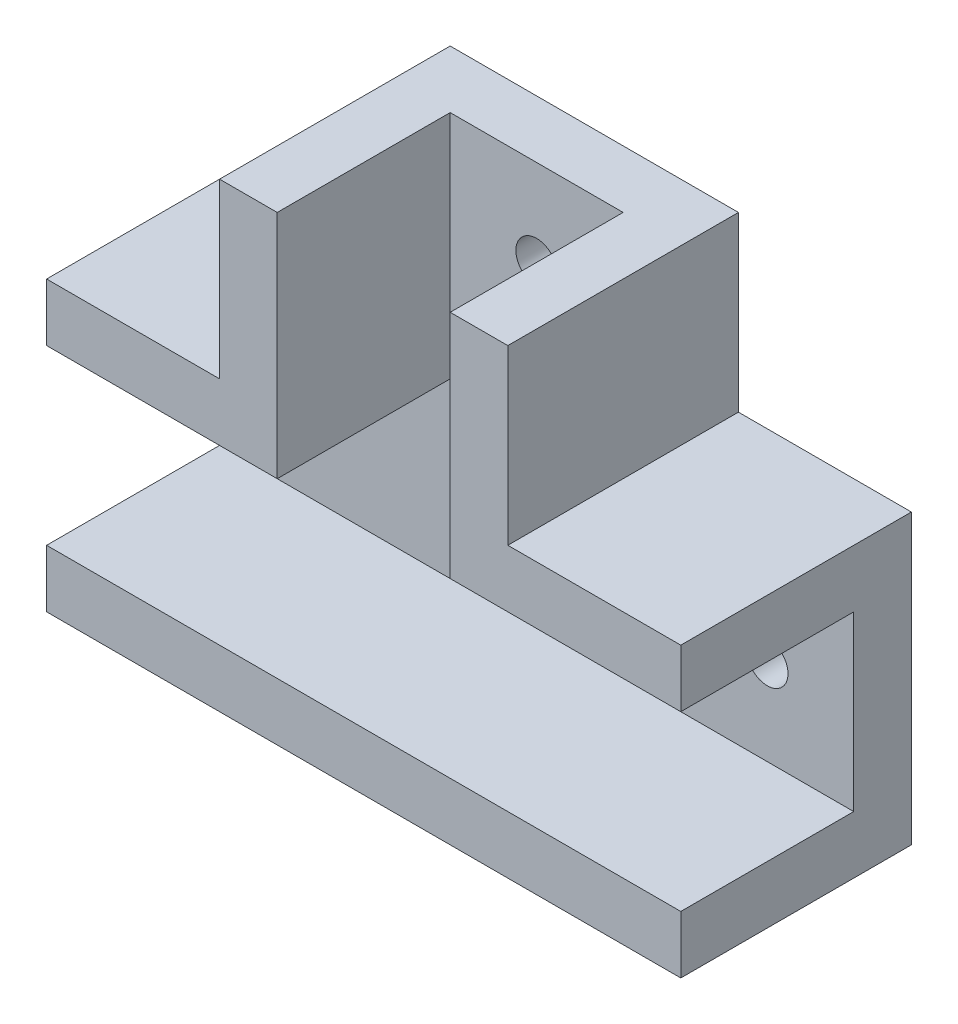
ISO-10303-21;
HEADER;
FILE_DESCRIPTION(('STEP AP214'),'2;1');
FILE_NAME('part.step','',(''),(''),'','','');
FILE_SCHEMA(('AUTOMOTIVE_DESIGN { 1 0 10303 214 1 1 1 1 }'));
ENDSEC;
DATA;
#1=APPLICATION_CONTEXT('core data for automotive mechanical design processes');
#2=APPLICATION_PROTOCOL_DEFINITION('international standard','automotive_design',2000,#1);
#3=PRODUCT_CONTEXT('',#1,'mechanical');
#4=PRODUCT('Part','Part','',(#3));
#5=PRODUCT_RELATED_PRODUCT_CATEGORY('part','',(#4));
#6=PRODUCT_DEFINITION_FORMATION('','',#4);
#7=PRODUCT_DEFINITION_CONTEXT('part definition',#1,'design');
#8=PRODUCT_DEFINITION('design','',#6,#7);
#9=PRODUCT_DEFINITION_SHAPE('','',#8);
#10=(LENGTH_UNIT() NAMED_UNIT(*) SI_UNIT(.MILLI.,.METRE.));
#11=(NAMED_UNIT(*) PLANE_ANGLE_UNIT() SI_UNIT($,.RADIAN.));
#12=(NAMED_UNIT(*) SI_UNIT($,.STERADIAN.) SOLID_ANGLE_UNIT());
#13=UNCERTAINTY_MEASURE_WITH_UNIT(LENGTH_MEASURE(1.E-05),#10,'distance_accuracy_value','');
#14=(GEOMETRIC_REPRESENTATION_CONTEXT(3) GLOBAL_UNCERTAINTY_ASSIGNED_CONTEXT((#13)) GLOBAL_UNIT_ASSIGNED_CONTEXT((#10,
#11,#12)) REPRESENTATION_CONTEXT('',''));
#15=CARTESIAN_POINT('',(0.,0.,0.));
#16=DIRECTION('',(0.,0.,1.));
#17=DIRECTION('',(1.,0.,0.));
#18=AXIS2_PLACEMENT_3D('',#15,#16,#17);
#19=CARTESIAN_POINT('',(-20.6862745098039,-4.26470588235294,5.));
#20=DIRECTION('',(1.,0.,0.));
#21=DIRECTION('',(0.,1.,0.));
#22=AXIS2_PLACEMENT_3D('',#19,#20,#21);
#23=PLANE('',#22);
#24=DIRECTION('',(0.,-1.,0.));
#25=VECTOR('',#24,1.);
#26=CARTESIAN_POINT('',(-20.6862745098039,-4.26470588235294,0.));
#27=LINE('',#26,#25);
#28=CARTESIAN_POINT('',(-20.6862745098039,0.735294117647059,0.));
#29=VERTEX_POINT('',#28);
#30=CARTESIAN_POINT('',(-20.6862745098039,-24.2647058823529,0.));
#31=VERTEX_POINT('',#30);
#32=EDGE_CURVE('E248',#29,#31,#27,.T.);
#33=ORIENTED_EDGE('',*,*,#32,.T.);
#34=DIRECTION('',(0.,0.,-1.));
#35=VECTOR('',#34,1.);
#36=CARTESIAN_POINT('',(-20.6862745098039,-24.2647058823529,20.));
#37=LINE('',#36,#35);
#38=CARTESIAN_POINT('',(-20.6862745098039,-24.2647058823529,20.));
#39=VERTEX_POINT('',#38);
#40=EDGE_CURVE('E213',#39,#31,#37,.T.);
#41=ORIENTED_EDGE('',*,*,#40,.F.);
#42=DIRECTION('',(0.,1.,0.));
#43=VECTOR('',#42,1.);
#44=CARTESIAN_POINT('',(-20.6862745098039,-24.2647058823529,20.));
#45=LINE('',#44,#43);
#46=CARTESIAN_POINT('',(-20.6862745098039,-19.2647058823529,20.));
#47=VERTEX_POINT('',#46);
#48=EDGE_CURVE('E198',#39,#47,#45,.T.);
#49=ORIENTED_EDGE('',*,*,#48,.T.);
#50=DIRECTION('',(0.,0.,-1.));
#51=VECTOR('',#50,1.);
#52=CARTESIAN_POINT('',(-20.6862745098039,-19.2647058823529,20.));
#53=LINE('',#52,#51);
#54=CARTESIAN_POINT('',(-20.6862745098039,-19.2647058823529,5.));
#55=VERTEX_POINT('',#54);
#56=EDGE_CURVE('E210',#47,#55,#53,.T.);
#57=ORIENTED_EDGE('',*,*,#56,.T.);
#58=DIRECTION('',(0.,-1.,0.));
#59=VECTOR('',#58,1.);
#60=CARTESIAN_POINT('',(-20.6862745098039,-4.26470588235294,5.));
#61=LINE('',#60,#59);
#62=CARTESIAN_POINT('',(-20.6862745098039,-4.26470588235294,5.));
#63=VERTEX_POINT('',#62);
#64=EDGE_CURVE('E262',#63,#55,#61,.T.);
#65=ORIENTED_EDGE('',*,*,#64,.F.);
#66=DIRECTION('',(0.,0.,-1.));
#67=VECTOR('',#66,1.);
#68=CARTESIAN_POINT('',(-20.6862745098039,-4.26470588235294,20.));
#69=LINE('',#68,#67);
#70=CARTESIAN_POINT('',(-20.6862745098039,-4.26470588235294,20.));
#71=VERTEX_POINT('',#70);
#72=EDGE_CURVE('E245',#71,#63,#69,.T.);
#73=ORIENTED_EDGE('',*,*,#72,.F.);
#74=DIRECTION('',(0.,1.,0.));
#75=VECTOR('',#74,1.);
#76=CARTESIAN_POINT('',(-20.6862745098039,-4.26470588235294,20.));
#77=LINE('',#76,#75);
#78=CARTESIAN_POINT('',(-20.6862745098039,0.735294117647059,20.));
#79=VERTEX_POINT('',#78);
#80=EDGE_CURVE('E224',#71,#79,#77,.T.);
#81=ORIENTED_EDGE('',*,*,#80,.T.);
#82=DIRECTION('',(0.,0.,-1.));
#83=VECTOR('',#82,1.);
#84=CARTESIAN_POINT('',(-20.6862745098039,0.735294117647059,20.));
#85=LINE('',#84,#83);
#86=EDGE_CURVE('E240',#79,#29,#85,.T.);
#87=ORIENTED_EDGE('',*,*,#86,.T.);
#88=EDGE_LOOP('',(#33,#41,#49,#57,#65,#73,#81,#87));
#89=FACE_BOUND('',#88,.T.);
#90=ADVANCED_FACE('F33',(#89),#23,.F.);
#91=CARTESIAN_POINT('',(34.3137254901961,-4.26470588235294,5.));
#92=DIRECTION('',(-1.,0.,0.));
#93=DIRECTION('',(0.,0.,1.));
#94=AXIS2_PLACEMENT_3D('',#91,#92,#93);
#95=PLANE('',#94);
#96=DIRECTION('',(0.,1.,0.));
#97=VECTOR('',#96,1.);
#98=CARTESIAN_POINT('',(34.3137254901961,-4.26470588235294,0.));
#99=LINE('',#98,#97);
#100=CARTESIAN_POINT('',(34.3137254901961,-24.2647058823529,0.));
#101=VERTEX_POINT('',#100);
#102=CARTESIAN_POINT('',(34.3137254901961,0.735294117647054,0.));
#103=VERTEX_POINT('',#102);
#104=EDGE_CURVE('E275',#101,#103,#99,.T.);
#105=ORIENTED_EDGE('',*,*,#104,.T.);
#106=DIRECTION('',(0.,0.,-1.));
#107=VECTOR('',#106,1.);
#108=CARTESIAN_POINT('',(34.3137254901961,0.735294117647054,20.));
#109=LINE('',#108,#107);
#110=CARTESIAN_POINT('',(34.3137254901961,0.735294117647054,20.));
#111=VERTEX_POINT('',#110);
#112=EDGE_CURVE('E161',#111,#103,#109,.T.);
#113=ORIENTED_EDGE('',*,*,#112,.F.);
#114=DIRECTION('',(0.,1.,0.));
#115=VECTOR('',#114,1.);
#116=CARTESIAN_POINT('',(34.3137254901961,-4.26470588235295,20.));
#117=LINE('',#116,#115);
#118=CARTESIAN_POINT('',(34.3137254901961,-4.26470588235295,20.));
#119=VERTEX_POINT('',#118);
#120=EDGE_CURVE('E158',#119,#111,#117,.T.);
#121=ORIENTED_EDGE('',*,*,#120,.F.);
#122=DIRECTION('',(0.,0.,-1.));
#123=VECTOR('',#122,1.);
#124=CARTESIAN_POINT('',(34.3137254901961,-4.26470588235295,20.));
#125=LINE('',#124,#123);
#126=CARTESIAN_POINT('',(34.3137254901961,-4.26470588235294,5.));
#127=VERTEX_POINT('',#126);
#128=EDGE_CURVE('E144',#119,#127,#125,.T.);
#129=ORIENTED_EDGE('',*,*,#128,.T.);
#130=DIRECTION('',(0.,1.,0.));
#131=VECTOR('',#130,1.);
#132=CARTESIAN_POINT('',(34.3137254901961,-4.26470588235294,5.));
#133=LINE('',#132,#131);
#134=CARTESIAN_POINT('',(34.3137254901961,-19.2647058823529,5.));
#135=VERTEX_POINT('',#134);
#136=EDGE_CURVE('E267',#135,#127,#133,.T.);
#137=ORIENTED_EDGE('',*,*,#136,.F.);
#138=DIRECTION('',(0.,0.,-1.));
#139=VECTOR('',#138,1.);
#140=CARTESIAN_POINT('',(34.3137254901961,-19.2647058823529,20.));
#141=LINE('',#140,#139);
#142=CARTESIAN_POINT('',(34.3137254901961,-19.2647058823529,20.));
#143=VERTEX_POINT('',#142);
#144=EDGE_CURVE('E220',#143,#135,#141,.T.);
#145=ORIENTED_EDGE('',*,*,#144,.F.);
#146=DIRECTION('',(0.,-1.,0.));
#147=VECTOR('',#146,1.);
#148=CARTESIAN_POINT('',(34.3137254901961,-19.2647058823529,20.));
#149=LINE('',#148,#147);
#150=CARTESIAN_POINT('',(34.3137254901961,-24.2647058823529,20.));
#151=VERTEX_POINT('',#150);
#152=EDGE_CURVE('E204',#143,#151,#149,.T.);
#153=ORIENTED_EDGE('',*,*,#152,.T.);
#154=DIRECTION('',(0.,0.,-1.));
#155=VECTOR('',#154,1.);
#156=CARTESIAN_POINT('',(34.3137254901961,-24.2647058823529,20.));
#157=LINE('',#156,#155);
#158=EDGE_CURVE('E217',#151,#101,#157,.T.);
#159=ORIENTED_EDGE('',*,*,#158,.T.);
#160=EDGE_LOOP('',(#105,#113,#121,#129,#137,#145,#153,#159));
#161=FACE_BOUND('',#160,.T.);
#162=ADVANCED_FACE('F159',(#161),#95,.F.);
#163=CARTESIAN_POINT('',(-0.686274509803913,15.7352941176471,5.));
#164=DIRECTION('',(0.,-1.,0.));
#165=DIRECTION('',(0.,0.,-1.));
#166=AXIS2_PLACEMENT_3D('',#163,#164,#165);
#167=PLANE('',#166);
#168=DIRECTION('',(-1.,0.,0.));
#169=VECTOR('',#168,1.);
#170=CARTESIAN_POINT('',(-0.686274509803913,15.7352941176471,0.));
#171=LINE('',#170,#169);
#172=CARTESIAN_POINT('',(19.3137254901961,15.7352941176471,0.));
#173=VERTEX_POINT('',#172);
#174=CARTESIAN_POINT('',(-5.68627450980391,15.7352941176471,0.));
#175=VERTEX_POINT('',#174);
#176=EDGE_CURVE('E36',#173,#175,#171,.T.);
#177=ORIENTED_EDGE('',*,*,#176,.T.);
#178=DIRECTION('',(0.,0.,-1.));
#179=VECTOR('',#178,1.);
#180=CARTESIAN_POINT('',(-5.68627450980391,15.7352941176471,20.));
#181=LINE('',#180,#179);
#182=CARTESIAN_POINT('',(-5.68627450980391,15.7352941176471,20.));
#183=VERTEX_POINT('',#182);
#184=EDGE_CURVE('E255',#183,#175,#181,.T.);
#185=ORIENTED_EDGE('',*,*,#184,.F.);
#186=DIRECTION('',(-1.,0.,0.));
#187=VECTOR('',#186,1.);
#188=CARTESIAN_POINT('',(-0.686274509803913,15.7352941176471,20.));
#189=LINE('',#188,#187);
#190=CARTESIAN_POINT('',(-0.686274509803913,15.7352941176471,20.));
#191=VERTEX_POINT('',#190);
#192=EDGE_CURVE('E233',#191,#183,#189,.T.);
#193=ORIENTED_EDGE('',*,*,#192,.F.);
#194=DIRECTION('',(0.,0.,-1.));
#195=VECTOR('',#194,1.);
#196=CARTESIAN_POINT('',(-0.686274509803913,15.7352941176471,20.));
#197=LINE('',#196,#195);
#198=CARTESIAN_POINT('',(-0.686274509803913,15.7352941176471,5.));
#199=VERTEX_POINT('',#198);
#200=EDGE_CURVE('E252',#191,#199,#197,.T.);
#201=ORIENTED_EDGE('',*,*,#200,.T.);
#202=DIRECTION('',(-1.,0.,0.));
#203=VECTOR('',#202,1.);
#204=CARTESIAN_POINT('',(-0.686274509803913,15.7352941176471,5.));
#205=LINE('',#204,#203);
#206=CARTESIAN_POINT('',(14.3137254901961,15.7352941176471,5.));
#207=VERTEX_POINT('',#206);
#208=EDGE_CURVE('E272',#207,#199,#205,.T.);
#209=ORIENTED_EDGE('',*,*,#208,.F.);
#210=DIRECTION('',(0.,0.,-1.));
#211=VECTOR('',#210,1.);
#212=CARTESIAN_POINT('',(14.3137254901961,15.7352941176471,20.));
#213=LINE('',#212,#211);
#214=CARTESIAN_POINT('',(14.3137254901961,15.7352941176471,20.));
#215=VERTEX_POINT('',#214);
#216=EDGE_CURVE('E194',#215,#207,#213,.T.);
#217=ORIENTED_EDGE('',*,*,#216,.F.);
#218=DIRECTION('',(1.,0.,0.));
#219=VECTOR('',#218,1.);
#220=CARTESIAN_POINT('',(14.3137254901961,15.7352941176471,20.));
#221=LINE('',#220,#219);
#222=CARTESIAN_POINT('',(19.3137254901961,15.7352941176471,20.));
#223=VERTEX_POINT('',#222);
#224=EDGE_CURVE('E171',#215,#223,#221,.T.);
#225=ORIENTED_EDGE('',*,*,#224,.T.);
#226=DIRECTION('',(0.,0.,-1.));
#227=VECTOR('',#226,1.);
#228=CARTESIAN_POINT('',(19.3137254901961,15.7352941176471,20.));
#229=LINE('',#228,#227);
#230=EDGE_CURVE('E191',#223,#173,#229,.T.);
#231=ORIENTED_EDGE('',*,*,#230,.T.);
#232=EDGE_LOOP('',(#177,#185,#193,#201,#209,#217,#225,#231));
#233=FACE_BOUND('',#232,.T.);
#234=ADVANCED_FACE('F279',(#233),#167,.F.);
#235=CARTESIAN_POINT('',(0.,0.,5.));
#236=DIRECTION('',(0.,0.,1.));
#237=DIRECTION('',(1.,0.,0.));
#238=AXIS2_PLACEMENT_3D('',#235,#236,#237);
#239=PLANE('',#238);
#240=CARTESIAN_POINT('',(6.81372549019609,8.23529411764706,5.));
#241=DIRECTION('',(0.,0.,1.));
#242=DIRECTION('',(1.,0.,0.));
#243=AXIS2_PLACEMENT_3D('',#240,#241,#242);
#244=CIRCLE('',#243,1.8);
#245=CARTESIAN_POINT('',(8.61372549019609,8.23529411764706,5.));
#246=VERTEX_POINT('',#245);
#247=EDGE_CURVE('E530',#246,#246,#244,.T.);
#248=ORIENTED_EDGE('',*,*,#247,.F.);
#249=EDGE_LOOP('',(#248));
#250=FACE_BOUND('',#249,.T.);
#251=CARTESIAN_POINT('',(-13.1862745098039,-11.7647058823529,5.));
#252=DIRECTION('',(0.,0.,1.));
#253=DIRECTION('',(1.,0.,0.));
#254=AXIS2_PLACEMENT_3D('',#251,#252,#253);
#255=CIRCLE('',#254,1.8);
#256=CARTESIAN_POINT('',(-11.3862745098039,-11.7647058823529,5.));
#257=VERTEX_POINT('',#256);
#258=EDGE_CURVE('E535',#257,#257,#255,.T.);
#259=ORIENTED_EDGE('',*,*,#258,.F.);
#260=EDGE_LOOP('',(#259));
#261=FACE_BOUND('',#260,.T.);
#262=CARTESIAN_POINT('',(26.8137254901961,-11.7647058823529,5.));
#263=DIRECTION('',(0.,0.,1.));
#264=DIRECTION('',(1.,0.,0.));
#265=AXIS2_PLACEMENT_3D('',#262,#263,#264);
#266=CIRCLE('',#265,1.8);
#267=CARTESIAN_POINT('',(28.6137254901961,-11.7647058823529,5.));
#268=VERTEX_POINT('',#267);
#269=EDGE_CURVE('E542',#268,#268,#266,.T.);
#270=ORIENTED_EDGE('',*,*,#269,.F.);
#271=EDGE_LOOP('',(#270));
#272=FACE_BOUND('',#271,.T.);
#273=ORIENTED_EDGE('',*,*,#64,.T.);
#274=DIRECTION('',(1.,0.,0.));
#275=VECTOR('',#274,1.);
#276=CARTESIAN_POINT('',(-20.6862745098039,-19.2647058823529,5.));
#277=LINE('',#276,#275);
#278=EDGE_CURVE('E264',#55,#135,#277,.T.);
#279=ORIENTED_EDGE('',*,*,#278,.T.);
#280=ORIENTED_EDGE('',*,*,#136,.T.);
#281=DIRECTION('',(-1.,0.,0.));
#282=VECTOR('',#281,1.);
#283=CARTESIAN_POINT('',(14.3137254901961,-4.26470588235294,5.));
#284=LINE('',#283,#282);
#285=CARTESIAN_POINT('',(14.3137254901961,-4.26470588235294,5.));
#286=VERTEX_POINT('',#285);
#287=EDGE_CURVE('E150',#127,#286,#284,.T.);
#288=ORIENTED_EDGE('',*,*,#287,.T.);
#289=DIRECTION('',(0.,1.,0.));
#290=VECTOR('',#289,1.);
#291=CARTESIAN_POINT('',(14.3137254901961,15.7352941176471,5.));
#292=LINE('',#291,#290);
#293=EDGE_CURVE('E270',#286,#207,#292,.T.);
#294=ORIENTED_EDGE('',*,*,#293,.T.);
#295=ORIENTED_EDGE('',*,*,#208,.T.);
#296=DIRECTION('',(0.,-1.,0.));
#297=VECTOR('',#296,1.);
#298=CARTESIAN_POINT('',(-0.686274509803913,15.7352941176471,5.));
#299=LINE('',#298,#297);
#300=CARTESIAN_POINT('',(-0.68627450980391,-4.26470588235294,5.));
#301=VERTEX_POINT('',#300);
#302=EDGE_CURVE('E41',#199,#301,#299,.T.);
#303=ORIENTED_EDGE('',*,*,#302,.T.);
#304=DIRECTION('',(-1.,0.,0.));
#305=VECTOR('',#304,1.);
#306=CARTESIAN_POINT('',(-20.6862745098039,-4.26470588235294,5.));
#307=LINE('',#306,#305);
#308=EDGE_CURVE('E11',#301,#63,#307,.T.);
#309=ORIENTED_EDGE('',*,*,#308,.T.);
#310=EDGE_LOOP('',(#273,#279,#280,#288,#294,#295,#303,#309));
#311=FACE_BOUND('',#310,.T.);
#312=ADVANCED_FACE('F312',(#250,#261,#272,#311),#239,.T.);
#313=CARTESIAN_POINT('',(0.,0.,0.));
#314=DIRECTION('',(0.,0.,1.));
#315=DIRECTION('',(1.,0.,0.));
#316=AXIS2_PLACEMENT_3D('',#313,#314,#315);
#317=PLANE('',#316);
#318=CARTESIAN_POINT('',(6.81372549019609,8.23529411764706,0.));
#319=DIRECTION('',(0.,0.,1.));
#320=DIRECTION('',(1.,0.,0.));
#321=AXIS2_PLACEMENT_3D('',#318,#319,#320);
#322=CIRCLE('',#321,1.8);
#323=CARTESIAN_POINT('',(8.61372549019609,8.23529411764706,0.));
#324=VERTEX_POINT('',#323);
#325=EDGE_CURVE('E184',#324,#324,#322,.T.);
#326=ORIENTED_EDGE('',*,*,#325,.T.);
#327=EDGE_LOOP('',(#326));
#328=FACE_BOUND('',#327,.T.);
#329=CARTESIAN_POINT('',(-13.1862745098039,-11.7647058823529,0.));
#330=DIRECTION('',(0.,0.,1.));
#331=DIRECTION('',(1.,0.,0.));
#332=AXIS2_PLACEMENT_3D('',#329,#330,#331);
#333=CIRCLE('',#332,1.8);
#334=CARTESIAN_POINT('',(-11.3862745098039,-11.7647058823529,0.));
#335=VERTEX_POINT('',#334);
#336=EDGE_CURVE('E531',#335,#335,#333,.T.);
#337=ORIENTED_EDGE('',*,*,#336,.T.);
#338=EDGE_LOOP('',(#337));
#339=FACE_BOUND('',#338,.T.);
#340=CARTESIAN_POINT('',(26.8137254901961,-11.7647058823529,0.));
#341=DIRECTION('',(0.,0.,1.));
#342=DIRECTION('',(1.,0.,0.));
#343=AXIS2_PLACEMENT_3D('',#340,#341,#342);
#344=CIRCLE('',#343,1.8);
#345=CARTESIAN_POINT('',(28.6137254901961,-11.7647058823529,0.));
#346=VERTEX_POINT('',#345);
#347=EDGE_CURVE('E540',#346,#346,#344,.T.);
#348=ORIENTED_EDGE('',*,*,#347,.T.);
#349=EDGE_LOOP('',(#348));
#350=FACE_BOUND('',#349,.T.);
#351=ORIENTED_EDGE('',*,*,#176,.F.);
#352=DIRECTION('',(0.,-1.,0.));
#353=VECTOR('',#352,1.);
#354=CARTESIAN_POINT('',(19.3137254901961,15.7352941176471,0.));
#355=LINE('',#354,#353);
#356=CARTESIAN_POINT('',(19.3137254901961,0.735294117647055,0.));
#357=VERTEX_POINT('',#356);
#358=EDGE_CURVE('E181',#173,#357,#355,.T.);
#359=ORIENTED_EDGE('',*,*,#358,.T.);
#360=DIRECTION('',(-1.,0.,0.));
#361=VECTOR('',#360,1.);
#362=CARTESIAN_POINT('',(34.3137254901961,0.735294117647054,0.));
#363=LINE('',#362,#361);
#364=EDGE_CURVE('E163',#103,#357,#363,.T.);
#365=ORIENTED_EDGE('',*,*,#364,.F.);
#366=ORIENTED_EDGE('',*,*,#104,.F.);
#367=DIRECTION('',(-1.,0.,0.));
#368=VECTOR('',#367,1.);
#369=CARTESIAN_POINT('',(34.3137254901961,-24.2647058823529,0.));
#370=LINE('',#369,#368);
#371=EDGE_CURVE('E187',#101,#31,#370,.T.);
#372=ORIENTED_EDGE('',*,*,#371,.T.);
#373=ORIENTED_EDGE('',*,*,#32,.F.);
#374=DIRECTION('',(1.,0.,0.));
#375=VECTOR('',#374,1.);
#376=CARTESIAN_POINT('',(-6.07997052750672,0.735294117647057,0.));
#377=LINE('',#376,#375);
#378=CARTESIAN_POINT('',(-5.68627450980391,0.735294117647057,0.));
#379=VERTEX_POINT('',#378);
#380=EDGE_CURVE('E216',#29,#379,#377,.T.);
#381=ORIENTED_EDGE('',*,*,#380,.T.);
#382=DIRECTION('',(0.,-1.,0.));
#383=VECTOR('',#382,1.);
#384=CARTESIAN_POINT('',(-5.68627450980391,15.7352941176471,0.));
#385=LINE('',#384,#383);
#386=EDGE_CURVE('E228',#175,#379,#385,.T.);
#387=ORIENTED_EDGE('',*,*,#386,.F.);
#388=EDGE_LOOP('',(#351,#359,#365,#366,#372,#373,#381,#387));
#389=FACE_BOUND('',#388,.T.);
#390=ADVANCED_FACE('F288',(#328,#339,#350,#389),#317,.F.);
#391=CARTESIAN_POINT('',(-20.6862745098039,-4.26470588235294,20.));
#392=DIRECTION('',(0.,1.,0.));
#393=DIRECTION('',(-1.,0.,0.));
#394=AXIS2_PLACEMENT_3D('',#391,#392,#393);
#395=PLANE('',#394);
#396=ORIENTED_EDGE('',*,*,#308,.F.);
#397=DIRECTION('',(0.,0.,-1.));
#398=VECTOR('',#397,1.);
#399=CARTESIAN_POINT('',(-0.686274509803916,-4.26470588235294,20.));
#400=LINE('',#399,#398);
#401=CARTESIAN_POINT('',(-0.686274509803916,-4.26470588235294,20.));
#402=VERTEX_POINT('',#401);
#403=EDGE_CURVE('E249',#402,#301,#400,.T.);
#404=ORIENTED_EDGE('',*,*,#403,.F.);
#405=DIRECTION('',(1.,0.,0.));
#406=VECTOR('',#405,1.);
#407=CARTESIAN_POINT('',(-20.6862745098039,-4.26470588235294,20.));
#408=LINE('',#407,#406);
#409=EDGE_CURVE('E238',#71,#402,#408,.T.);
#410=ORIENTED_EDGE('',*,*,#409,.F.);
#411=ORIENTED_EDGE('',*,*,#72,.T.);
#412=EDGE_LOOP('',(#396,#404,#410,#411));
#413=FACE_BOUND('',#412,.T.);
#414=ADVANCED_FACE('F304',(#413),#395,.F.);
#415=CARTESIAN_POINT('',(-0.686274509803913,15.7352941176471,20.));
#416=DIRECTION('',(1.,0.,0.));
#417=DIRECTION('',(0.,1.,0.));
#418=AXIS2_PLACEMENT_3D('',#415,#416,#417);
#419=PLANE('',#418);
#420=ORIENTED_EDGE('',*,*,#403,.T.);
#421=ORIENTED_EDGE('',*,*,#302,.F.);
#422=ORIENTED_EDGE('',*,*,#200,.F.);
#423=DIRECTION('',(0.,-1.,0.));
#424=VECTOR('',#423,1.);
#425=CARTESIAN_POINT('',(-0.686274509803913,15.7352941176471,20.));
#426=LINE('',#425,#424);
#427=EDGE_CURVE('E235',#191,#402,#426,.T.);
#428=ORIENTED_EDGE('',*,*,#427,.T.);
#429=EDGE_LOOP('',(#420,#421,#422,#428));
#430=FACE_BOUND('',#429,.T.);
#431=ADVANCED_FACE('F302',(#430),#419,.T.);
#432=CARTESIAN_POINT('',(-5.68627450980391,15.7352941176471,20.));
#433=DIRECTION('',(1.,0.,0.));
#434=DIRECTION('',(0.,1.,0.));
#435=AXIS2_PLACEMENT_3D('',#432,#433,#434);
#436=PLANE('',#435);
#437=ORIENTED_EDGE('',*,*,#386,.T.);
#438=DIRECTION('',(0.,0.,-1.));
#439=VECTOR('',#438,1.);
#440=CARTESIAN_POINT('',(-5.68627450980391,0.735294117647057,20.));
#441=LINE('',#440,#439);
#442=CARTESIAN_POINT('',(-5.68627450980391,0.735294117647057,20.));
#443=VERTEX_POINT('',#442);
#444=EDGE_CURVE('E258',#443,#379,#441,.T.);
#445=ORIENTED_EDGE('',*,*,#444,.F.);
#446=DIRECTION('',(0.,-1.,0.));
#447=VECTOR('',#446,1.);
#448=CARTESIAN_POINT('',(-5.68627450980391,15.7352941176471,20.));
#449=LINE('',#448,#447);
#450=EDGE_CURVE('E230',#183,#443,#449,.T.);
#451=ORIENTED_EDGE('',*,*,#450,.F.);
#452=ORIENTED_EDGE('',*,*,#184,.T.);
#453=EDGE_LOOP('',(#437,#445,#451,#452));
#454=FACE_BOUND('',#453,.T.);
#455=ADVANCED_FACE('F286',(#454),#436,.F.);
#456=CARTESIAN_POINT('',(-6.07997052750672,0.735294117647057,20.));
#457=DIRECTION('',(0.,1.,0.));
#458=DIRECTION('',(0.,0.,1.));
#459=AXIS2_PLACEMENT_3D('',#456,#457,#458);
#460=PLANE('',#459);
#461=ORIENTED_EDGE('',*,*,#380,.F.);
#462=ORIENTED_EDGE('',*,*,#86,.F.);
#463=DIRECTION('',(1.,0.,0.));
#464=VECTOR('',#463,1.);
#465=CARTESIAN_POINT('',(-20.6862745098039,0.735294117647059,20.));
#466=LINE('',#465,#464);
#467=EDGE_CURVE('E227',#79,#443,#466,.T.);
#468=ORIENTED_EDGE('',*,*,#467,.T.);
#469=ORIENTED_EDGE('',*,*,#444,.T.);
#470=EDGE_LOOP('',(#461,#462,#468,#469));
#471=FACE_BOUND('',#470,.T.);
#472=ADVANCED_FACE('F291',(#471),#460,.T.);
#473=CARTESIAN_POINT('',(0.,0.,20.));
#474=DIRECTION('',(0.,0.,-1.));
#475=DIRECTION('',(-1.,0.,0.));
#476=AXIS2_PLACEMENT_3D('',#473,#474,#475);
#477=PLANE('',#476);
#478=ORIENTED_EDGE('',*,*,#80,.F.);
#479=ORIENTED_EDGE('',*,*,#409,.T.);
#480=ORIENTED_EDGE('',*,*,#427,.F.);
#481=ORIENTED_EDGE('',*,*,#192,.T.);
#482=ORIENTED_EDGE('',*,*,#450,.T.);
#483=ORIENTED_EDGE('',*,*,#467,.F.);
#484=EDGE_LOOP('',(#478,#479,#480,#481,#482,#483));
#485=FACE_BOUND('',#484,.T.);
#486=ADVANCED_FACE('F297',(#485),#477,.F.);
#487=CARTESIAN_POINT('',(-20.6862745098039,-19.2647058823529,20.));
#488=DIRECTION('',(0.,1.,0.));
#489=DIRECTION('',(0.,0.,1.));
#490=AXIS2_PLACEMENT_3D('',#487,#488,#489);
#491=PLANE('',#490);
#492=ORIENTED_EDGE('',*,*,#278,.F.);
#493=ORIENTED_EDGE('',*,*,#56,.F.);
#494=DIRECTION('',(1.,0.,0.));
#495=VECTOR('',#494,1.);
#496=CARTESIAN_POINT('',(-20.6862745098039,-19.2647058823529,20.));
#497=LINE('',#496,#495);
#498=EDGE_CURVE('E201',#47,#143,#497,.T.);
#499=ORIENTED_EDGE('',*,*,#498,.T.);
#500=ORIENTED_EDGE('',*,*,#144,.T.);
#501=EDGE_LOOP('',(#492,#493,#499,#500));
#502=FACE_BOUND('',#501,.T.);
#503=ADVANCED_FACE('F345',(#502),#491,.T.);
#504=CARTESIAN_POINT('',(34.3137254901961,-24.2647058823529,20.));
#505=DIRECTION('',(0.,-1.,0.));
#506=DIRECTION('',(0.,0.,-1.));
#507=AXIS2_PLACEMENT_3D('',#504,#505,#506);
#508=PLANE('',#507);
#509=ORIENTED_EDGE('',*,*,#371,.F.);
#510=ORIENTED_EDGE('',*,*,#158,.F.);
#511=DIRECTION('',(-1.,0.,0.));
#512=VECTOR('',#511,1.);
#513=CARTESIAN_POINT('',(34.3137254901961,-24.2647058823529,20.));
#514=LINE('',#513,#512);
#515=EDGE_CURVE('E207',#151,#39,#514,.T.);
#516=ORIENTED_EDGE('',*,*,#515,.T.);
#517=ORIENTED_EDGE('',*,*,#40,.T.);
#518=EDGE_LOOP('',(#509,#510,#516,#517));
#519=FACE_BOUND('',#518,.T.);
#520=ADVANCED_FACE('F351',(#519),#508,.T.);
#521=CARTESIAN_POINT('',(0.,0.,20.));
#522=DIRECTION('',(0.,0.,-1.));
#523=DIRECTION('',(-1.,0.,0.));
#524=AXIS2_PLACEMENT_3D('',#521,#522,#523);
#525=PLANE('',#524);
#526=ORIENTED_EDGE('',*,*,#48,.F.);
#527=ORIENTED_EDGE('',*,*,#515,.F.);
#528=ORIENTED_EDGE('',*,*,#152,.F.);
#529=ORIENTED_EDGE('',*,*,#498,.F.);
#530=EDGE_LOOP('',(#526,#527,#528,#529));
#531=FACE_BOUND('',#530,.T.);
#532=ADVANCED_FACE('F359',(#531),#525,.F.);
#533=CARTESIAN_POINT('',(34.3137254901961,0.735294117647054,20.));
#534=DIRECTION('',(0.,-1.,0.));
#535=DIRECTION('',(1.,0.,0.));
#536=AXIS2_PLACEMENT_3D('',#533,#534,#535);
#537=PLANE('',#536);
#538=ORIENTED_EDGE('',*,*,#364,.T.);
#539=DIRECTION('',(0.,0.,-1.));
#540=VECTOR('',#539,1.);
#541=CARTESIAN_POINT('',(19.3137254901961,0.735294117647055,20.));
#542=LINE('',#541,#540);
#543=CARTESIAN_POINT('',(19.3137254901961,0.735294117647055,20.));
#544=VERTEX_POINT('',#543);
#545=EDGE_CURVE('E188',#544,#357,#542,.T.);
#546=ORIENTED_EDGE('',*,*,#545,.F.);
#547=DIRECTION('',(-1.,0.,0.));
#548=VECTOR('',#547,1.);
#549=CARTESIAN_POINT('',(19.7074215078989,0.735294117647055,20.));
#550=LINE('',#549,#548);
#551=EDGE_CURVE('E154',#111,#544,#550,.T.);
#552=ORIENTED_EDGE('',*,*,#551,.F.);
#553=ORIENTED_EDGE('',*,*,#112,.T.);
#554=EDGE_LOOP('',(#538,#546,#552,#553));
#555=FACE_BOUND('',#554,.T.);
#556=ADVANCED_FACE('F367',(#555),#537,.F.);
#557=CARTESIAN_POINT('',(19.3137254901961,15.7352941176471,20.));
#558=DIRECTION('',(1.,0.,0.));
#559=DIRECTION('',(0.,1.,0.));
#560=AXIS2_PLACEMENT_3D('',#557,#558,#559);
#561=PLANE('',#560);
#562=ORIENTED_EDGE('',*,*,#358,.F.);
#563=ORIENTED_EDGE('',*,*,#230,.F.);
#564=DIRECTION('',(0.,-1.,0.));
#565=VECTOR('',#564,1.);
#566=CARTESIAN_POINT('',(19.3137254901961,15.7352941176471,20.));
#567=LINE('',#566,#565);
#568=EDGE_CURVE('E177',#223,#544,#567,.T.);
#569=ORIENTED_EDGE('',*,*,#568,.T.);
#570=ORIENTED_EDGE('',*,*,#545,.T.);
#571=EDGE_LOOP('',(#562,#563,#569,#570));
#572=FACE_BOUND('',#571,.T.);
#573=ADVANCED_FACE('F375',(#572),#561,.T.);
#574=CARTESIAN_POINT('',(14.3137254901961,15.7352941176471,20.));
#575=DIRECTION('',(1.,0.,0.));
#576=DIRECTION('',(0.,1.,0.));
#577=AXIS2_PLACEMENT_3D('',#574,#575,#576);
#578=PLANE('',#577);
#579=ORIENTED_EDGE('',*,*,#293,.F.);
#580=DIRECTION('',(0.,0.,-1.));
#581=VECTOR('',#580,1.);
#582=CARTESIAN_POINT('',(14.3137254901961,-4.26470588235295,20.));
#583=LINE('',#582,#581);
#584=CARTESIAN_POINT('',(14.3137254901961,-4.26470588235295,20.));
#585=VERTEX_POINT('',#584);
#586=EDGE_CURVE('E153',#585,#286,#583,.T.);
#587=ORIENTED_EDGE('',*,*,#586,.F.);
#588=DIRECTION('',(0.,-1.,0.));
#589=VECTOR('',#588,1.);
#590=CARTESIAN_POINT('',(14.3137254901961,15.7352941176471,20.));
#591=LINE('',#590,#589);
#592=EDGE_CURVE('E168',#215,#585,#591,.T.);
#593=ORIENTED_EDGE('',*,*,#592,.F.);
#594=ORIENTED_EDGE('',*,*,#216,.T.);
#595=EDGE_LOOP('',(#579,#587,#593,#594));
#596=FACE_BOUND('',#595,.T.);
#597=ADVANCED_FACE('F384',(#596),#578,.F.);
#598=CARTESIAN_POINT('',(34.3137254901961,-4.26470588235295,20.));
#599=DIRECTION('',(0.,-1.,0.));
#600=DIRECTION('',(1.,0.,0.));
#601=AXIS2_PLACEMENT_3D('',#598,#599,#600);
#602=PLANE('',#601);
#603=ORIENTED_EDGE('',*,*,#586,.T.);
#604=ORIENTED_EDGE('',*,*,#287,.F.);
#605=ORIENTED_EDGE('',*,*,#128,.F.);
#606=DIRECTION('',(-1.,0.,0.));
#607=VECTOR('',#606,1.);
#608=CARTESIAN_POINT('',(34.3137254901961,-4.26470588235295,20.));
#609=LINE('',#608,#607);
#610=EDGE_CURVE('E149',#119,#585,#609,.T.);
#611=ORIENTED_EDGE('',*,*,#610,.T.);
#612=EDGE_LOOP('',(#603,#604,#605,#611));
#613=FACE_BOUND('',#612,.T.);
#614=ADVANCED_FACE('F147',(#613),#602,.T.);
#615=CARTESIAN_POINT('',(13.6274509803922,0.,20.));
#616=DIRECTION('',(0.,0.,-1.));
#617=DIRECTION('',(1.,0.,0.));
#618=AXIS2_PLACEMENT_3D('',#615,#616,#617);
#619=PLANE('',#618);
#620=ORIENTED_EDGE('',*,*,#120,.T.);
#621=ORIENTED_EDGE('',*,*,#551,.T.);
#622=ORIENTED_EDGE('',*,*,#568,.F.);
#623=ORIENTED_EDGE('',*,*,#224,.F.);
#624=ORIENTED_EDGE('',*,*,#592,.T.);
#625=ORIENTED_EDGE('',*,*,#610,.F.);
#626=EDGE_LOOP('',(#620,#621,#622,#623,#624,#625));
#627=FACE_BOUND('',#626,.T.);
#628=ADVANCED_FACE('F165',(#627),#619,.F.);
#629=CARTESIAN_POINT('',(26.8137254901961,-11.7647058823529,0.));
#630=DIRECTION('',(0.,0.,1.));
#631=DIRECTION('',(1.,0.,0.));
#632=AXIS2_PLACEMENT_3D('',#629,#630,#631);
#633=CYLINDRICAL_SURFACE('',#632,1.8);
#634=ORIENTED_EDGE('',*,*,#347,.F.);
#635=EDGE_LOOP('',(#634));
#636=FACE_BOUND('',#635,.T.);
#637=ORIENTED_EDGE('',*,*,#269,.T.);
#638=EDGE_LOOP('',(#637));
#639=FACE_BOUND('',#638,.T.);
#640=ADVANCED_FACE('F405',(#636,#639),#633,.F.);
#641=CARTESIAN_POINT('',(-13.1862745098039,-11.7647058823529,0.));
#642=DIRECTION('',(0.,0.,1.));
#643=DIRECTION('',(1.,0.,0.));
#644=AXIS2_PLACEMENT_3D('',#641,#642,#643);
#645=CYLINDRICAL_SURFACE('',#644,1.8);
#646=ORIENTED_EDGE('',*,*,#336,.F.);
#647=EDGE_LOOP('',(#646));
#648=FACE_BOUND('',#647,.T.);
#649=ORIENTED_EDGE('',*,*,#258,.T.);
#650=EDGE_LOOP('',(#649));
#651=FACE_BOUND('',#650,.T.);
#652=ADVANCED_FACE('F413',(#648,#651),#645,.F.);
#653=CARTESIAN_POINT('',(6.81372549019609,8.23529411764706,0.));
#654=DIRECTION('',(0.,0.,1.));
#655=DIRECTION('',(1.,0.,0.));
#656=AXIS2_PLACEMENT_3D('',#653,#654,#655);
#657=CYLINDRICAL_SURFACE('',#656,1.8);
#658=ORIENTED_EDGE('',*,*,#325,.F.);
#659=EDGE_LOOP('',(#658));
#660=FACE_BOUND('',#659,.T.);
#661=ORIENTED_EDGE('',*,*,#247,.T.);
#662=EDGE_LOOP('',(#661));
#663=FACE_BOUND('',#662,.T.);
#664=ADVANCED_FACE('F422',(#660,#663),#657,.F.);
#665=CLOSED_SHELL('',(#90,#162,#234,#312,#390,#414,#431,#455,#472,#486,#503,#520,#532,#556,#573,
#597,#614,#628,#640,#652,#664));
#666=MANIFOLD_SOLID_BREP('B2',#665);
#667=ADVANCED_BREP_SHAPE_REPRESENTATION('',(#18,#666),#14);
#668=SHAPE_DEFINITION_REPRESENTATION(#9,#667);
ENDSEC;
END-ISO-10303-21;
